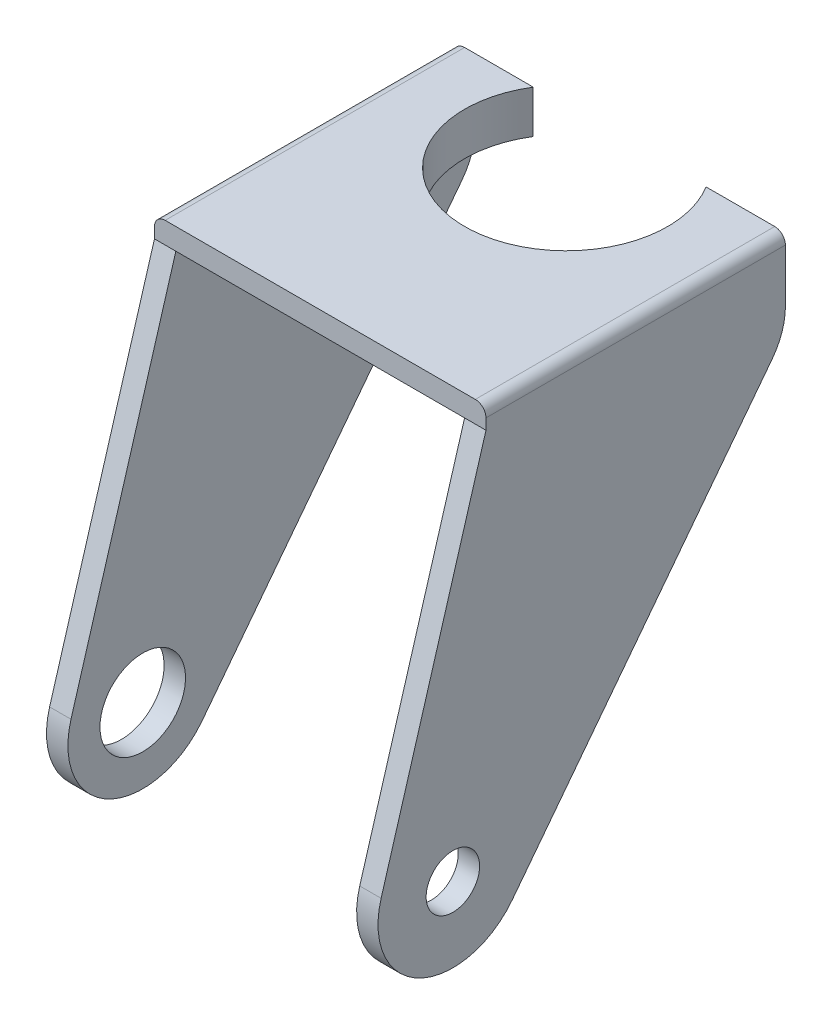
ISO-10303-21;
HEADER;
FILE_DESCRIPTION(('STEP AP214'),'2;1');
FILE_NAME('part.step','',(''),(''),'','','');
FILE_SCHEMA(('AUTOMOTIVE_DESIGN { 1 0 10303 214 1 1 1 1 }'));
ENDSEC;
DATA;
#1=APPLICATION_CONTEXT('core data for automotive mechanical design processes');
#2=APPLICATION_PROTOCOL_DEFINITION('international standard','automotive_design',2000,#1);
#3=PRODUCT_CONTEXT('',#1,'mechanical');
#4=PRODUCT('Part','Part','',(#3));
#5=PRODUCT_RELATED_PRODUCT_CATEGORY('part','',(#4));
#6=PRODUCT_DEFINITION_FORMATION('','',#4);
#7=PRODUCT_DEFINITION_CONTEXT('part definition',#1,'design');
#8=PRODUCT_DEFINITION('design','',#6,#7);
#9=PRODUCT_DEFINITION_SHAPE('','',#8);
#10=(LENGTH_UNIT() NAMED_UNIT(*) SI_UNIT(.MILLI.,.METRE.));
#11=(NAMED_UNIT(*) PLANE_ANGLE_UNIT() SI_UNIT($,.RADIAN.));
#12=(NAMED_UNIT(*) SI_UNIT($,.STERADIAN.) SOLID_ANGLE_UNIT());
#13=UNCERTAINTY_MEASURE_WITH_UNIT(LENGTH_MEASURE(1.E-05),#10,'distance_accuracy_value','');
#14=(GEOMETRIC_REPRESENTATION_CONTEXT(3) GLOBAL_UNCERTAINTY_ASSIGNED_CONTEXT((#13)) GLOBAL_UNIT_ASSIGNED_CONTEXT((#10,
#11,#12)) REPRESENTATION_CONTEXT('',''));
#15=CARTESIAN_POINT('',(0.,0.,0.));
#16=DIRECTION('',(0.,0.,1.));
#17=DIRECTION('',(1.,0.,0.));
#18=AXIS2_PLACEMENT_3D('',#15,#16,#17);
#19=CARTESIAN_POINT('',(-1.,18.4969997464512,-15.548289728614));
#20=DIRECTION('',(0.,0.,-1.));
#21=DIRECTION('',(0.,1.,0.));
#22=AXIS2_PLACEMENT_3D('',#19,#20,#21);
#23=PLANE('',#22);
#24=DIRECTION('',(0.,1.,0.));
#25=VECTOR('',#24,1.);
#26=CARTESIAN_POINT('',(-15.5,17.4969997464512,-15.548289728614));
#27=LINE('',#26,#25);
#28=CARTESIAN_POINT('',(-15.5,15.5161662727373,-15.548289728614));
#29=VERTEX_POINT('',#28);
#30=CARTESIAN_POINT('',(-15.5,17.9969997464512,-15.548289728614));
#31=VERTEX_POINT('',#30);
#32=EDGE_CURVE('E210',#29,#31,#27,.T.);
#33=ORIENTED_EDGE('',*,*,#32,.T.);
#34=CARTESIAN_POINT('',(-15.,17.9969997464512,-15.548289728614));
#35=DIRECTION('',(0.,0.,-1.));
#36=DIRECTION('',(0.,1.,0.));
#37=AXIS2_PLACEMENT_3D('',#34,#35,#36);
#38=CIRCLE('',#37,0.5);
#39=CARTESIAN_POINT('',(-15.,18.4969997464512,-15.548289728614));
#40=VERTEX_POINT('',#39);
#41=EDGE_CURVE('E281',#31,#40,#38,.T.);
#42=ORIENTED_EDGE('',*,*,#41,.T.);
#43=DIRECTION('',(1.,0.,0.));
#44=VECTOR('',#43,1.);
#45=CARTESIAN_POINT('',(-1.,18.4969997464512,-15.548289728614));
#46=LINE('',#45,#44);
#47=CARTESIAN_POINT('',(-12.9280787943023,18.4969997464512,-15.548289728614));
#48=VERTEX_POINT('',#47);
#49=EDGE_CURVE('E257',#40,#48,#46,.T.);
#50=ORIENTED_EDGE('',*,*,#49,.T.);
#51=DIRECTION('',(3.07167038101021E-13,1.,0.));
#52=VECTOR('',#51,1.);
#53=CARTESIAN_POINT('',(-12.9280787943023,18.4969997464549,-15.548289728614));
#54=LINE('',#53,#52);
#55=CARTESIAN_POINT('',(-12.9280787943023,17.4969997464512,-15.548289728614));
#56=VERTEX_POINT('',#55);
#57=EDGE_CURVE('E180',#56,#48,#54,.T.);
#58=ORIENTED_EDGE('',*,*,#57,.F.);
#59=DIRECTION('',(-1.,0.,0.));
#60=VECTOR('',#59,1.);
#61=CARTESIAN_POINT('',(-15.5,17.4969997464512,-15.548289728614));
#62=LINE('',#61,#60);
#63=CARTESIAN_POINT('',(-14.5,17.4969997464512,-15.548289728614));
#64=VERTEX_POINT('',#63);
#65=EDGE_CURVE('E201',#56,#64,#62,.T.);
#66=ORIENTED_EDGE('',*,*,#65,.T.);
#67=DIRECTION('',(0.,1.,0.));
#68=VECTOR('',#67,1.);
#69=CARTESIAN_POINT('',(-14.5,18.4969997464512,-15.548289728614));
#70=LINE('',#69,#68);
#71=CARTESIAN_POINT('',(-14.5,15.5161662727373,-15.548289728614));
#72=VERTEX_POINT('',#71);
#73=EDGE_CURVE('E327',#72,#64,#70,.T.);
#74=ORIENTED_EDGE('',*,*,#73,.F.);
#75=DIRECTION('',(-1.,0.,0.));
#76=VECTOR('',#75,1.);
#77=CARTESIAN_POINT('',(-14.5,15.5161662727373,-15.548289728614));
#78=LINE('',#77,#76);
#79=EDGE_CURVE('E346',#72,#29,#78,.T.);
#80=ORIENTED_EDGE('',*,*,#79,.T.);
#81=EDGE_LOOP('',(#33,#42,#50,#58,#66,#74,#80));
#82=FACE_BOUND('',#81,.T.);
#83=ADVANCED_FACE('F33',(#82),#23,.T.);
#84=CARTESIAN_POINT('',(0.,17.4969997464512,0.));
#85=DIRECTION('',(0.,1.,0.));
#86=DIRECTION('',(0.,0.,1.));
#87=AXIS2_PLACEMENT_3D('',#84,#85,#86);
#88=PLANE('',#87);
#89=ORIENTED_EDGE('',*,*,#65,.F.);
#90=CARTESIAN_POINT('',(-7.75,17.4969997464512,-13.048289728614));
#91=DIRECTION('',(0.,1.,0.));
#92=DIRECTION('',(0.,0.,1.));
#93=AXIS2_PLACEMENT_3D('',#90,#91,#92);
#94=CIRCLE('',#93,5.75);
#95=CARTESIAN_POINT('',(-2.57192120569801,17.4969997464512,-15.548289728614));
#96=VERTEX_POINT('',#95);
#97=EDGE_CURVE('E187',#56,#96,#94,.T.);
#98=ORIENTED_EDGE('',*,*,#97,.T.);
#99=CARTESIAN_POINT('',(-1.,17.4969997464512,-15.548289728614));
#100=VERTEX_POINT('',#99);
#101=EDGE_CURVE('E198',#100,#96,#62,.T.);
#102=ORIENTED_EDGE('',*,*,#101,.F.);
#103=DIRECTION('',(0.,0.,1.));
#104=VECTOR('',#103,1.);
#105=CARTESIAN_POINT('',(-1.,17.4969997464512,0.));
#106=LINE('',#105,#104);
#107=CARTESIAN_POINT('',(-1.,17.4969997464512,-1.54828972861397));
#108=VERTEX_POINT('',#107);
#109=EDGE_CURVE('E216',#100,#108,#106,.T.);
#110=ORIENTED_EDGE('',*,*,#109,.T.);
#111=DIRECTION('',(1.,0.,0.));
#112=VECTOR('',#111,1.);
#113=CARTESIAN_POINT('',(-15.5,17.4969997464512,-1.54828972861397));
#114=LINE('',#113,#112);
#115=CARTESIAN_POINT('',(-14.5,17.4969997464512,-1.54828972861397));
#116=VERTEX_POINT('',#115);
#117=EDGE_CURVE('E295',#116,#108,#114,.T.);
#118=ORIENTED_EDGE('',*,*,#117,.F.);
#119=DIRECTION('',(0.,0.,1.));
#120=VECTOR('',#119,1.);
#121=CARTESIAN_POINT('',(-14.5,17.4969997464512,0.));
#122=LINE('',#121,#120);
#123=EDGE_CURVE('E181',#64,#116,#122,.T.);
#124=ORIENTED_EDGE('',*,*,#123,.F.);
#125=EDGE_LOOP('',(#89,#98,#102,#110,#118,#124));
#126=FACE_BOUND('',#125,.T.);
#127=ADVANCED_FACE('F196',(#126),#88,.F.);
#128=CARTESIAN_POINT('',(-1.,0.,0.));
#129=DIRECTION('',(1.,0.,0.));
#130=DIRECTION('',(0.,0.,-1.));
#131=AXIS2_PLACEMENT_3D('',#128,#129,#130);
#132=PLANE('',#131);
#133=CARTESIAN_POINT('',(-1.,0.,0.));
#134=DIRECTION('',(1.,0.,0.));
#135=DIRECTION('',(0.,0.,-1.));
#136=AXIS2_PLACEMENT_3D('',#133,#134,#135);
#137=CIRCLE('',#136,1.25);
#138=CARTESIAN_POINT('',(-1.,0.,-1.25));
#139=VERTEX_POINT('',#138);
#140=EDGE_CURVE('E405',#139,#139,#137,.T.);
#141=ORIENTED_EDGE('',*,*,#140,.T.);
#142=EDGE_LOOP('',(#141));
#143=FACE_BOUND('',#142,.T.);
#144=ORIENTED_EDGE('',*,*,#109,.F.);
#145=DIRECTION('',(0.,1.,0.));
#146=VECTOR('',#145,1.);
#147=CARTESIAN_POINT('',(-1.,18.4969997464512,-15.548289728614));
#148=LINE('',#147,#146);
#149=CARTESIAN_POINT('',(-1.,15.5161662727373,-15.548289728614));
#150=VERTEX_POINT('',#149);
#151=EDGE_CURVE('E207',#150,#100,#148,.T.);
#152=ORIENTED_EDGE('',*,*,#151,.F.);
#153=CARTESIAN_POINT('',(-1.,15.5161662727373,-12.548289728614));
#154=DIRECTION('',(1.,0.,0.));
#155=DIRECTION('',(0.,0.,1.));
#156=AXIS2_PLACEMENT_3D('',#153,#154,#155);
#157=CIRCLE('',#156,3.);
#158=CARTESIAN_POINT('',(-1.,13.6887387445706,-14.9274720733069));
#159=VERTEX_POINT('',#158);
#160=EDGE_CURVE('E227',#159,#150,#157,.T.);
#161=ORIENTED_EDGE('',*,*,#160,.F.);
#162=DIRECTION('',(0.,0.793060781564328,-0.609142509388876));
#163=VECTOR('',#162,1.);
#164=CARTESIAN_POINT('',(-1.,13.6887387445706,-14.9274720733069));
#165=LINE('',#164,#163);
#166=CARTESIAN_POINT('',(-1.,-2.13199878286107,-2.77571273547515));
#167=VERTEX_POINT('',#166);
#168=EDGE_CURVE('E223',#167,#159,#165,.T.);
#169=ORIENTED_EDGE('',*,*,#168,.F.);
#170=CARTESIAN_POINT('',(-1.,0.,0.));
#171=DIRECTION('',(1.,0.,0.));
#172=DIRECTION('',(0.,0.,-1.));
#173=AXIS2_PLACEMENT_3D('',#170,#171,#172);
#174=CIRCLE('',#173,3.5);
#175=CARTESIAN_POINT('',(-1.,0.996999746451241,3.35499500827887));
#176=VERTEX_POINT('',#175);
#177=EDGE_CURVE('E220',#176,#167,#174,.T.);
#178=ORIENTED_EDGE('',*,*,#177,.F.);
#179=DIRECTION('',(0.,-0.958570002365392,0.28485707041464));
#180=VECTOR('',#179,1.);
#181=CARTESIAN_POINT('',(-1.,0.996999746451241,3.35499500827887));
#182=LINE('',#181,#180);
#183=EDGE_CURVE('E231',#108,#176,#182,.T.);
#184=ORIENTED_EDGE('',*,*,#183,.F.);
#185=EDGE_LOOP('',(#144,#152,#161,#169,#178,#184));
#186=FACE_BOUND('',#185,.T.);
#187=ADVANCED_FACE('F312',(#143,#186),#132,.F.);
#188=CARTESIAN_POINT('',(-1.,0.,0.));
#189=DIRECTION('',(1.,0.,0.));
#190=DIRECTION('',(0.,0.,-1.));
#191=AXIS2_PLACEMENT_3D('',#188,#189,#190);
#192=CYLINDRICAL_SURFACE('',#191,3.5);
#193=CARTESIAN_POINT('',(0.,0.,0.));
#194=DIRECTION('',(1.,0.,0.));
#195=DIRECTION('',(0.,0.,-1.));
#196=AXIS2_PLACEMENT_3D('',#193,#194,#195);
#197=CIRCLE('',#196,3.5);
#198=CARTESIAN_POINT('',(0.,0.996999746451241,3.35499500827887));
#199=VERTEX_POINT('',#198);
#200=CARTESIAN_POINT('',(0.,-2.13199878286107,-2.77571273547515));
#201=VERTEX_POINT('',#200);
#202=EDGE_CURVE('E219',#199,#201,#197,.T.);
#203=ORIENTED_EDGE('',*,*,#202,.F.);
#204=DIRECTION('',(1.,0.,0.));
#205=VECTOR('',#204,1.);
#206=CARTESIAN_POINT('',(-1.,0.996999746451241,3.35499500827887));
#207=LINE('',#206,#205);
#208=EDGE_CURVE('E249',#176,#199,#207,.T.);
#209=ORIENTED_EDGE('',*,*,#208,.F.);
#210=ORIENTED_EDGE('',*,*,#177,.T.);
#211=DIRECTION('',(1.,0.,0.));
#212=VECTOR('',#211,1.);
#213=CARTESIAN_POINT('',(-1.,-2.13199878286107,-2.77571273547515));
#214=LINE('',#213,#212);
#215=EDGE_CURVE('E234',#167,#201,#214,.T.);
#216=ORIENTED_EDGE('',*,*,#215,.T.);
#217=EDGE_LOOP('',(#203,#209,#210,#216));
#218=FACE_BOUND('',#217,.T.);
#219=ADVANCED_FACE('F302',(#218),#192,.T.);
#220=CARTESIAN_POINT('',(-1.,0.996999746451241,3.35499500827887));
#221=DIRECTION('',(0.,0.28485707041464,0.958570002365393));
#222=DIRECTION('',(0.,-0.958570002365393,0.28485707041464));
#223=AXIS2_PLACEMENT_3D('',#220,#221,#222);
#224=PLANE('',#223);
#225=DIRECTION('',(0.,-0.958570002365392,0.28485707041464));
#226=VECTOR('',#225,1.);
#227=CARTESIAN_POINT('',(0.,0.996999746451241,3.35499500827887));
#228=LINE('',#227,#226);
#229=CARTESIAN_POINT('',(0.,17.4969997464512,-1.54828972861397));
#230=VERTEX_POINT('',#229);
#231=EDGE_CURVE('E224',#230,#199,#228,.T.);
#232=ORIENTED_EDGE('',*,*,#231,.F.);
#233=DIRECTION('',(1.,0.,0.));
#234=VECTOR('',#233,1.);
#235=CARTESIAN_POINT('',(-1.,17.4969997464512,-1.54828972861397));
#236=LINE('',#235,#234);
#237=EDGE_CURVE('E251',#108,#230,#236,.T.);
#238=ORIENTED_EDGE('',*,*,#237,.F.);
#239=ORIENTED_EDGE('',*,*,#183,.T.);
#240=ORIENTED_EDGE('',*,*,#208,.T.);
#241=EDGE_LOOP('',(#232,#238,#239,#240));
#242=FACE_BOUND('',#241,.T.);
#243=ADVANCED_FACE('F298',(#242),#224,.T.);
#244=CARTESIAN_POINT('',(-1.,17.4969997464512,-1.54828972861397));
#245=DIRECTION('',(0.,0.,1.));
#246=DIRECTION('',(1.,0.,0.));
#247=AXIS2_PLACEMENT_3D('',#244,#245,#246);
#248=PLANE('',#247);
#249=DIRECTION('',(1.,0.,0.));
#250=VECTOR('',#249,1.);
#251=CARTESIAN_POINT('',(-1.,18.4969997464512,-1.54828972861397));
#252=LINE('',#251,#250);
#253=CARTESIAN_POINT('',(-15.,18.4969997464512,-1.54828972861397));
#254=VERTEX_POINT('',#253);
#255=CARTESIAN_POINT('',(-0.5,18.4969997464512,-1.54828972861397));
#256=VERTEX_POINT('',#255);
#257=EDGE_CURVE('E254',#254,#256,#252,.T.);
#258=ORIENTED_EDGE('',*,*,#257,.F.);
#259=CARTESIAN_POINT('',(-15.,17.9969997464512,-1.54828972861397));
#260=DIRECTION('',(0.,0.,1.));
#261=DIRECTION('',(1.,0.,0.));
#262=AXIS2_PLACEMENT_3D('',#259,#260,#261);
#263=CIRCLE('',#262,0.5);
#264=CARTESIAN_POINT('',(-15.5,17.9969997464512,-1.54828972861397));
#265=VERTEX_POINT('',#264);
#266=EDGE_CURVE('E278',#254,#265,#263,.T.);
#267=ORIENTED_EDGE('',*,*,#266,.T.);
#268=DIRECTION('',(0.,1.,0.));
#269=VECTOR('',#268,1.);
#270=CARTESIAN_POINT('',(-15.5,17.4969997464512,-1.54828972861397));
#271=LINE('',#270,#269);
#272=CARTESIAN_POINT('',(-15.5,17.4969997464512,-1.54828972861397));
#273=VERTEX_POINT('',#272);
#274=EDGE_CURVE('E208',#273,#265,#271,.T.);
#275=ORIENTED_EDGE('',*,*,#274,.F.);
#276=EDGE_CURVE('E212',#273,#116,#114,.T.);
#277=ORIENTED_EDGE('',*,*,#276,.T.);
#278=ORIENTED_EDGE('',*,*,#117,.T.);
#279=ORIENTED_EDGE('',*,*,#237,.T.);
#280=DIRECTION('',(0.,-1.,0.));
#281=VECTOR('',#280,1.);
#282=CARTESIAN_POINT('',(0.,17.4969997464512,-1.54828972861397));
#283=LINE('',#282,#281);
#284=CARTESIAN_POINT('',(0.,17.9969997464512,-1.54828972861397));
#285=VERTEX_POINT('',#284);
#286=EDGE_CURVE('E245',#285,#230,#283,.T.);
#287=ORIENTED_EDGE('',*,*,#286,.F.);
#288=CARTESIAN_POINT('',(-0.5,17.9969997464512,-1.54828972861397));
#289=DIRECTION('',(0.,0.,1.));
#290=DIRECTION('',(1.,0.,0.));
#291=AXIS2_PLACEMENT_3D('',#288,#289,#290);
#292=CIRCLE('',#291,0.5);
#293=EDGE_CURVE('E276',#285,#256,#292,.T.);
#294=ORIENTED_EDGE('',*,*,#293,.T.);
#295=EDGE_LOOP('',(#258,#267,#275,#277,#278,#279,#287,#294));
#296=FACE_BOUND('',#295,.T.);
#297=ADVANCED_FACE('F290',(#296),#248,.T.);
#298=CARTESIAN_POINT('',(-1.,18.4969997464512,-1.54828972861397));
#299=DIRECTION('',(0.,1.,0.));
#300=DIRECTION('',(0.,0.,1.));
#301=AXIS2_PLACEMENT_3D('',#298,#299,#300);
#302=PLANE('',#301);
#303=ORIENTED_EDGE('',*,*,#49,.F.);
#304=DIRECTION('',(0.,0.,1.));
#305=VECTOR('',#304,1.);
#306=CARTESIAN_POINT('',(-15.,18.4969997464512,-1.54828972861397));
#307=LINE('',#306,#305);
#308=EDGE_CURVE('E273',#40,#254,#307,.T.);
#309=ORIENTED_EDGE('',*,*,#308,.T.);
#310=ORIENTED_EDGE('',*,*,#257,.T.);
#311=DIRECTION('',(0.,0.,1.));
#312=VECTOR('',#311,1.);
#313=CARTESIAN_POINT('',(-0.5,18.4969997464512,-1.54828972861397));
#314=LINE('',#313,#312);
#315=CARTESIAN_POINT('',(-0.5,18.4969997464512,-15.548289728614));
#316=VERTEX_POINT('',#315);
#317=EDGE_CURVE('E271',#256,#316,#314,.F.);
#318=ORIENTED_EDGE('',*,*,#317,.T.);
#319=CARTESIAN_POINT('',(-2.57192120569801,18.4969997464512,-15.548289728614));
#320=VERTEX_POINT('',#319);
#321=EDGE_CURVE('E259',#320,#316,#46,.T.);
#322=ORIENTED_EDGE('',*,*,#321,.F.);
#323=DIRECTION('',(0.99999820524696,0.,-0.00189459833726096));
#324=VECTOR('',#323,1.);
#325=CARTESIAN_POINT('',(-1.02652997153261,18.4969997464512,-15.5512176295315));
#326=LINE('',#325,#324);
#327=CARTESIAN_POINT('',(-3.70979277514982,18.4969997464512,-15.5461339151613));
#328=VERTEX_POINT('',#327);
#329=EDGE_CURVE('E177',#328,#320,#326,.T.);
#330=ORIENTED_EDGE('',*,*,#329,.F.);
#331=CARTESIAN_POINT('',(-7.75,18.4969997464512,-13.048289728614));
#332=DIRECTION('',(0.,1.,0.));
#333=DIRECTION('',(0.,0.,1.));
#334=AXIS2_PLACEMENT_3D('',#331,#332,#333);
#335=CIRCLE('',#334,4.75);
#336=CARTESIAN_POINT('',(-11.7902072248502,18.4969997464512,-15.5461339151613));
#337=VERTEX_POINT('',#336);
#338=EDGE_CURVE('E268',#337,#328,#335,.T.);
#339=ORIENTED_EDGE('',*,*,#338,.F.);
#340=DIRECTION('',(0.99999820524696,0.,0.00189459833725892));
#341=VECTOR('',#340,1.);
#342=CARTESIAN_POINT('',(-0.973518486756022,18.4969997464512,-15.525640597883));
#343=LINE('',#342,#341);
#344=EDGE_CURVE('E396',#48,#337,#343,.T.);
#345=ORIENTED_EDGE('',*,*,#344,.F.);
#346=EDGE_LOOP('',(#303,#309,#310,#318,#322,#330,#339,#345));
#347=FACE_BOUND('',#346,.T.);
#348=ADVANCED_FACE('F367',(#347),#302,.T.);
#349=ORIENTED_EDGE('',*,*,#321,.T.);
#350=CARTESIAN_POINT('',(-0.5,17.9969997464512,-15.548289728614));
#351=DIRECTION('',(0.,0.,-1.));
#352=DIRECTION('',(0.,1.,0.));
#353=AXIS2_PLACEMENT_3D('',#350,#351,#352);
#354=CIRCLE('',#353,0.5);
#355=CARTESIAN_POINT('',(0.,17.9969997464512,-15.548289728614));
#356=VERTEX_POINT('',#355);
#357=EDGE_CURVE('E11',#316,#356,#354,.T.);
#358=ORIENTED_EDGE('',*,*,#357,.T.);
#359=DIRECTION('',(0.,1.,0.));
#360=VECTOR('',#359,1.);
#361=CARTESIAN_POINT('',(0.,18.4969997464512,-15.548289728614));
#362=LINE('',#361,#360);
#363=CARTESIAN_POINT('',(0.,15.5161662727373,-15.548289728614));
#364=VERTEX_POINT('',#363);
#365=EDGE_CURVE('E243',#364,#356,#362,.T.);
#366=ORIENTED_EDGE('',*,*,#365,.F.);
#367=DIRECTION('',(1.,0.,0.));
#368=VECTOR('',#367,1.);
#369=CARTESIAN_POINT('',(-1.,15.5161662727373,-15.548289728614));
#370=LINE('',#369,#368);
#371=EDGE_CURVE('E260',#150,#364,#370,.T.);
#372=ORIENTED_EDGE('',*,*,#371,.F.);
#373=ORIENTED_EDGE('',*,*,#151,.T.);
#374=ORIENTED_EDGE('',*,*,#101,.T.);
#375=DIRECTION('',(3.0716703810069E-13,-1.,0.));
#376=VECTOR('',#375,1.);
#377=CARTESIAN_POINT('',(-2.57192120569801,18.4969997464508,-15.548289728614));
#378=LINE('',#377,#376);
#379=EDGE_CURVE('E170',#320,#96,#378,.T.);
#380=ORIENTED_EDGE('',*,*,#379,.F.);
#381=EDGE_LOOP('',(#349,#358,#366,#372,#373,#374,#380));
#382=FACE_BOUND('',#381,.T.);
#383=ADVANCED_FACE('F205',(#382),#23,.T.);
#384=CARTESIAN_POINT('',(-1.,15.5161662727373,-12.548289728614));
#385=DIRECTION('',(1.,0.,0.));
#386=DIRECTION('',(0.,0.,-1.));
#387=AXIS2_PLACEMENT_3D('',#384,#385,#386);
#388=CYLINDRICAL_SURFACE('',#387,3.);
#389=CARTESIAN_POINT('',(0.,15.5161662727373,-12.548289728614));
#390=DIRECTION('',(1.,0.,0.));
#391=DIRECTION('',(0.,0.,1.));
#392=AXIS2_PLACEMENT_3D('',#389,#390,#391);
#393=CIRCLE('',#392,3.);
#394=CARTESIAN_POINT('',(0.,13.6887387445706,-14.9274720733069));
#395=VERTEX_POINT('',#394);
#396=EDGE_CURVE('E240',#395,#364,#393,.T.);
#397=ORIENTED_EDGE('',*,*,#396,.F.);
#398=DIRECTION('',(1.,0.,0.));
#399=VECTOR('',#398,1.);
#400=CARTESIAN_POINT('',(-1.,13.6887387445706,-14.9274720733069));
#401=LINE('',#400,#399);
#402=EDGE_CURVE('E262',#159,#395,#401,.T.);
#403=ORIENTED_EDGE('',*,*,#402,.F.);
#404=ORIENTED_EDGE('',*,*,#160,.T.);
#405=ORIENTED_EDGE('',*,*,#371,.T.);
#406=EDGE_LOOP('',(#397,#403,#404,#405));
#407=FACE_BOUND('',#406,.T.);
#408=ADVANCED_FACE('F310',(#407),#388,.T.);
#409=CARTESIAN_POINT('',(-1.,13.6887387445706,-14.9274720733069));
#410=DIRECTION('',(0.,-0.609142509388876,-0.793060781564328));
#411=DIRECTION('',(0.,0.793060781564328,-0.609142509388876));
#412=AXIS2_PLACEMENT_3D('',#409,#410,#411);
#413=PLANE('',#412);
#414=DIRECTION('',(0.,0.793060781564328,-0.609142509388876));
#415=VECTOR('',#414,1.);
#416=CARTESIAN_POINT('',(0.,13.6887387445706,-14.9274720733069));
#417=LINE('',#416,#415);
#418=EDGE_CURVE('E237',#201,#395,#417,.T.);
#419=ORIENTED_EDGE('',*,*,#418,.F.);
#420=ORIENTED_EDGE('',*,*,#215,.F.);
#421=ORIENTED_EDGE('',*,*,#168,.T.);
#422=ORIENTED_EDGE('',*,*,#402,.T.);
#423=EDGE_LOOP('',(#419,#420,#421,#422));
#424=FACE_BOUND('',#423,.T.);
#425=ADVANCED_FACE('F306',(#424),#413,.T.);
#426=CARTESIAN_POINT('',(0.,0.,0.));
#427=DIRECTION('',(1.,0.,0.));
#428=DIRECTION('',(0.,0.,-1.));
#429=AXIS2_PLACEMENT_3D('',#426,#427,#428);
#430=PLANE('',#429);
#431=CARTESIAN_POINT('',(0.,0.,0.));
#432=DIRECTION('',(1.,0.,0.));
#433=DIRECTION('',(0.,0.,-1.));
#434=AXIS2_PLACEMENT_3D('',#431,#432,#433);
#435=CIRCLE('',#434,1.25);
#436=CARTESIAN_POINT('',(0.,0.,-1.25));
#437=VERTEX_POINT('',#436);
#438=EDGE_CURVE('E408',#437,#437,#435,.T.);
#439=ORIENTED_EDGE('',*,*,#438,.F.);
#440=EDGE_LOOP('',(#439));
#441=FACE_BOUND('',#440,.T.);
#442=ORIENTED_EDGE('',*,*,#365,.T.);
#443=DIRECTION('',(0.,0.,1.));
#444=VECTOR('',#443,1.);
#445=CARTESIAN_POINT('',(0.,17.9969997464512,0.));
#446=LINE('',#445,#444);
#447=EDGE_CURVE('E41',#356,#285,#446,.T.);
#448=ORIENTED_EDGE('',*,*,#447,.T.);
#449=ORIENTED_EDGE('',*,*,#286,.T.);
#450=ORIENTED_EDGE('',*,*,#231,.T.);
#451=ORIENTED_EDGE('',*,*,#202,.T.);
#452=ORIENTED_EDGE('',*,*,#418,.T.);
#453=ORIENTED_EDGE('',*,*,#396,.T.);
#454=EDGE_LOOP('',(#442,#448,#449,#450,#451,#452,#453));
#455=FACE_BOUND('',#454,.T.);
#456=ADVANCED_FACE('F286',(#441,#455),#430,.T.);
#457=CARTESIAN_POINT('',(-15.5,17.4969997464512,-15.548289728614));
#458=DIRECTION('',(-1.,0.,0.));
#459=DIRECTION('',(0.,0.,1.));
#460=AXIS2_PLACEMENT_3D('',#457,#458,#459);
#461=PLANE('',#460);
#462=CARTESIAN_POINT('',(-15.5,0.,0.));
#463=DIRECTION('',(-1.,0.,0.));
#464=DIRECTION('',(0.,0.,1.));
#465=AXIS2_PLACEMENT_3D('',#462,#463,#464);
#466=CIRCLE('',#465,2.);
#467=CARTESIAN_POINT('',(-15.5,0.,2.));
#468=VERTEX_POINT('',#467);
#469=EDGE_CURVE('E399',#468,#468,#466,.F.);
#470=ORIENTED_EDGE('',*,*,#469,.T.);
#471=EDGE_LOOP('',(#470));
#472=FACE_BOUND('',#471,.T.);
#473=ORIENTED_EDGE('',*,*,#274,.T.);
#474=DIRECTION('',(0.,0.,1.));
#475=VECTOR('',#474,1.);
#476=CARTESIAN_POINT('',(-15.5,17.9969997464512,-15.548289728614));
#477=LINE('',#476,#475);
#478=EDGE_CURVE('E54',#265,#31,#477,.F.);
#479=ORIENTED_EDGE('',*,*,#478,.T.);
#480=ORIENTED_EDGE('',*,*,#32,.F.);
#481=CARTESIAN_POINT('',(-15.5,15.5161662727373,-12.548289728614));
#482=DIRECTION('',(1.,0.,0.));
#483=DIRECTION('',(0.,0.,1.));
#484=AXIS2_PLACEMENT_3D('',#481,#482,#483);
#485=CIRCLE('',#484,3.);
#486=CARTESIAN_POINT('',(-15.5,13.6887387445706,-14.9274720733069));
#487=VERTEX_POINT('',#486);
#488=EDGE_CURVE('E340',#487,#29,#485,.T.);
#489=ORIENTED_EDGE('',*,*,#488,.F.);
#490=DIRECTION('',(0.,0.793060781564328,-0.609142509388876));
#491=VECTOR('',#490,1.);
#492=CARTESIAN_POINT('',(-15.5,13.6887387445706,-14.9274720733069));
#493=LINE('',#492,#491);
#494=CARTESIAN_POINT('',(-15.5,-2.13199878286107,-2.77571273547515));
#495=VERTEX_POINT('',#494);
#496=EDGE_CURVE('E338',#495,#487,#493,.T.);
#497=ORIENTED_EDGE('',*,*,#496,.F.);
#498=CARTESIAN_POINT('',(-15.5,0.,0.));
#499=DIRECTION('',(1.,0.,0.));
#500=DIRECTION('',(0.,0.,-1.));
#501=AXIS2_PLACEMENT_3D('',#498,#499,#500);
#502=CIRCLE('',#501,3.5);
#503=CARTESIAN_POINT('',(-15.5,0.996999746451241,3.35499500827887));
#504=VERTEX_POINT('',#503);
#505=EDGE_CURVE('E202',#504,#495,#502,.T.);
#506=ORIENTED_EDGE('',*,*,#505,.F.);
#507=DIRECTION('',(0.,-0.958570002365392,0.28485707041464));
#508=VECTOR('',#507,1.);
#509=CARTESIAN_POINT('',(-15.5,0.996999746451241,3.35499500827887));
#510=LINE('',#509,#508);
#511=EDGE_CURVE('E320',#273,#504,#510,.T.);
#512=ORIENTED_EDGE('',*,*,#511,.F.);
#513=EDGE_LOOP('',(#473,#479,#480,#489,#497,#506,#512));
#514=FACE_BOUND('',#513,.T.);
#515=ADVANCED_FACE('F357',(#472,#514),#461,.T.);
#516=CARTESIAN_POINT('',(-14.5,0.,0.));
#517=DIRECTION('',(-1.,0.,0.));
#518=DIRECTION('',(0.,0.,-1.));
#519=AXIS2_PLACEMENT_3D('',#516,#517,#518);
#520=PLANE('',#519);
#521=CARTESIAN_POINT('',(-14.5,0.,0.));
#522=DIRECTION('',(-1.,0.,0.));
#523=DIRECTION('',(0.,0.,1.));
#524=AXIS2_PLACEMENT_3D('',#521,#522,#523);
#525=CIRCLE('',#524,2.);
#526=CARTESIAN_POINT('',(-14.5,0.,2.));
#527=VERTEX_POINT('',#526);
#528=EDGE_CURVE('E402',#527,#527,#525,.T.);
#529=ORIENTED_EDGE('',*,*,#528,.T.);
#530=EDGE_LOOP('',(#529));
#531=FACE_BOUND('',#530,.T.);
#532=ORIENTED_EDGE('',*,*,#73,.T.);
#533=ORIENTED_EDGE('',*,*,#123,.T.);
#534=DIRECTION('',(0.,-0.958570002365392,0.28485707041464));
#535=VECTOR('',#534,1.);
#536=CARTESIAN_POINT('',(-14.5,0.996999746451241,3.35499500827887));
#537=LINE('',#536,#535);
#538=CARTESIAN_POINT('',(-14.5,0.996999746451241,3.35499500827887));
#539=VERTEX_POINT('',#538);
#540=EDGE_CURVE('E322',#116,#539,#537,.T.);
#541=ORIENTED_EDGE('',*,*,#540,.T.);
#542=CARTESIAN_POINT('',(-14.5,0.,0.));
#543=DIRECTION('',(1.,0.,0.));
#544=DIRECTION('',(0.,0.,-1.));
#545=AXIS2_PLACEMENT_3D('',#542,#543,#544);
#546=CIRCLE('',#545,3.5);
#547=CARTESIAN_POINT('',(-14.5,-2.13199878286107,-2.77571273547515));
#548=VERTEX_POINT('',#547);
#549=EDGE_CURVE('E344',#539,#548,#546,.T.);
#550=ORIENTED_EDGE('',*,*,#549,.T.);
#551=DIRECTION('',(0.,0.793060781564328,-0.609142509388876));
#552=VECTOR('',#551,1.);
#553=CARTESIAN_POINT('',(-14.5,13.6887387445706,-14.9274720733069));
#554=LINE('',#553,#552);
#555=CARTESIAN_POINT('',(-14.5,13.6887387445706,-14.9274720733069));
#556=VERTEX_POINT('',#555);
#557=EDGE_CURVE('E373',#548,#556,#554,.T.);
#558=ORIENTED_EDGE('',*,*,#557,.T.);
#559=CARTESIAN_POINT('',(-14.5,15.5161662727373,-12.548289728614));
#560=DIRECTION('',(1.,0.,0.));
#561=DIRECTION('',(0.,0.,1.));
#562=AXIS2_PLACEMENT_3D('',#559,#560,#561);
#563=CIRCLE('',#562,3.);
#564=EDGE_CURVE('E332',#556,#72,#563,.T.);
#565=ORIENTED_EDGE('',*,*,#564,.T.);
#566=EDGE_LOOP('',(#532,#533,#541,#550,#558,#565));
#567=FACE_BOUND('',#566,.T.);
#568=ADVANCED_FACE('F377',(#531,#567),#520,.F.);
#569=CARTESIAN_POINT('',(-14.5,0.,0.));
#570=DIRECTION('',(-1.,0.,0.));
#571=DIRECTION('',(0.,0.,-1.));
#572=AXIS2_PLACEMENT_3D('',#569,#570,#571);
#573=CYLINDRICAL_SURFACE('',#572,3.5);
#574=ORIENTED_EDGE('',*,*,#505,.T.);
#575=DIRECTION('',(-1.,0.,0.));
#576=VECTOR('',#575,1.);
#577=CARTESIAN_POINT('',(-14.5,-2.13199878286107,-2.77571273547515));
#578=LINE('',#577,#576);
#579=EDGE_CURVE('E326',#548,#495,#578,.T.);
#580=ORIENTED_EDGE('',*,*,#579,.F.);
#581=ORIENTED_EDGE('',*,*,#549,.F.);
#582=DIRECTION('',(-1.,0.,0.));
#583=VECTOR('',#582,1.);
#584=CARTESIAN_POINT('',(-14.5,0.996999746451241,3.35499500827887));
#585=LINE('',#584,#583);
#586=EDGE_CURVE('E313',#539,#504,#585,.T.);
#587=ORIENTED_EDGE('',*,*,#586,.T.);
#588=EDGE_LOOP('',(#574,#580,#581,#587));
#589=FACE_BOUND('',#588,.T.);
#590=ADVANCED_FACE('F372',(#589),#573,.T.);
#591=CARTESIAN_POINT('',(-14.5,0.996999746451241,3.35499500827887));
#592=DIRECTION('',(0.,0.28485707041464,0.958570002365393));
#593=DIRECTION('',(0.,-0.958570002365393,0.28485707041464));
#594=AXIS2_PLACEMENT_3D('',#591,#592,#593);
#595=PLANE('',#594);
#596=ORIENTED_EDGE('',*,*,#511,.T.);
#597=ORIENTED_EDGE('',*,*,#586,.F.);
#598=ORIENTED_EDGE('',*,*,#540,.F.);
#599=ORIENTED_EDGE('',*,*,#276,.F.);
#600=EDGE_LOOP('',(#596,#597,#598,#599));
#601=FACE_BOUND('',#600,.T.);
#602=ADVANCED_FACE('F318',(#601),#595,.T.);
#603=CARTESIAN_POINT('',(-14.5,15.5161662727373,-12.548289728614));
#604=DIRECTION('',(-1.,0.,0.));
#605=DIRECTION('',(0.,0.,-1.));
#606=AXIS2_PLACEMENT_3D('',#603,#604,#605);
#607=CYLINDRICAL_SURFACE('',#606,3.);
#608=ORIENTED_EDGE('',*,*,#488,.T.);
#609=ORIENTED_EDGE('',*,*,#79,.F.);
#610=ORIENTED_EDGE('',*,*,#564,.F.);
#611=DIRECTION('',(-1.,0.,0.));
#612=VECTOR('',#611,1.);
#613=CARTESIAN_POINT('',(-14.5,13.6887387445706,-14.9274720733069));
#614=LINE('',#613,#612);
#615=EDGE_CURVE('E330',#556,#487,#614,.T.);
#616=ORIENTED_EDGE('',*,*,#615,.T.);
#617=EDGE_LOOP('',(#608,#609,#610,#616));
#618=FACE_BOUND('',#617,.T.);
#619=ADVANCED_FACE('F354',(#618),#607,.T.);
#620=CARTESIAN_POINT('',(-14.5,13.6887387445706,-14.9274720733069));
#621=DIRECTION('',(0.,-0.609142509388876,-0.793060781564328));
#622=DIRECTION('',(0.,0.793060781564328,-0.609142509388876));
#623=AXIS2_PLACEMENT_3D('',#620,#621,#622);
#624=PLANE('',#623);
#625=ORIENTED_EDGE('',*,*,#496,.T.);
#626=ORIENTED_EDGE('',*,*,#615,.F.);
#627=ORIENTED_EDGE('',*,*,#557,.F.);
#628=ORIENTED_EDGE('',*,*,#579,.T.);
#629=EDGE_LOOP('',(#625,#626,#627,#628));
#630=FACE_BOUND('',#629,.T.);
#631=ADVANCED_FACE('F476',(#630),#624,.T.);
#632=CARTESIAN_POINT('',(-7.75,16.4969997464512,-13.048289728614));
#633=DIRECTION('',(0.,1.,0.));
#634=DIRECTION('',(0.,0.,1.));
#635=AXIS2_PLACEMENT_3D('',#632,#633,#634);
#636=CYLINDRICAL_SURFACE('',#635,4.75);
#637=DIRECTION('',(0.,1.,0.));
#638=VECTOR('',#637,1.);
#639=CARTESIAN_POINT('',(-11.7902072248502,16.4969997464512,-15.5461339151613));
#640=LINE('',#639,#638);
#641=CARTESIAN_POINT('',(-11.7902072248502,16.4969997464512,-15.5461339151613));
#642=VERTEX_POINT('',#641);
#643=EDGE_CURVE('E385',#642,#337,#640,.T.);
#644=ORIENTED_EDGE('',*,*,#643,.T.);
#645=ORIENTED_EDGE('',*,*,#338,.T.);
#646=DIRECTION('',(0.,1.,0.));
#647=VECTOR('',#646,1.);
#648=CARTESIAN_POINT('',(-3.70979277514982,16.4969997464512,-15.5461339151613));
#649=LINE('',#648,#647);
#650=CARTESIAN_POINT('',(-3.70979277514982,16.4969997464512,-15.5461339151613));
#651=VERTEX_POINT('',#650);
#652=EDGE_CURVE('E192',#651,#328,#649,.T.);
#653=ORIENTED_EDGE('',*,*,#652,.F.);
#654=CARTESIAN_POINT('',(-7.75,16.4969997464512,-13.048289728614));
#655=DIRECTION('',(0.,-1.,0.));
#656=DIRECTION('',(0.,0.,1.));
#657=AXIS2_PLACEMENT_3D('',#654,#655,#656);
#658=CIRCLE('',#657,4.75);
#659=EDGE_CURVE('E393',#651,#642,#658,.T.);
#660=ORIENTED_EDGE('',*,*,#659,.T.);
#661=EDGE_LOOP('',(#644,#645,#653,#660));
#662=FACE_BOUND('',#661,.T.);
#663=ADVANCED_FACE('F471',(#662),#636,.F.);
#664=CARTESIAN_POINT('',(-3.70979277514982,16.4969997464512,-15.5461339151613));
#665=DIRECTION('',(-0.00189459833726096,0.,-0.99999820524696));
#666=DIRECTION('',(-0.99999820524696,0.,0.00189459833726096));
#667=AXIS2_PLACEMENT_3D('',#664,#665,#666);
#668=PLANE('',#667);
#669=ORIENTED_EDGE('',*,*,#652,.T.);
#670=ORIENTED_EDGE('',*,*,#329,.T.);
#671=ORIENTED_EDGE('',*,*,#379,.T.);
#672=DIRECTION('',(0.,1.,0.));
#673=VECTOR('',#672,1.);
#674=CARTESIAN_POINT('',(-2.57192120569801,16.4969997464512,-15.548289728614));
#675=LINE('',#674,#673);
#676=CARTESIAN_POINT('',(-2.57192120569801,16.4969997464512,-15.548289728614));
#677=VERTEX_POINT('',#676);
#678=EDGE_CURVE('E174',#677,#96,#675,.T.);
#679=ORIENTED_EDGE('',*,*,#678,.F.);
#680=DIRECTION('',(-0.99999820524696,0.,0.00189459833726096));
#681=VECTOR('',#680,1.);
#682=CARTESIAN_POINT('',(-3.70979277514982,16.4969997464512,-15.5461339151613));
#683=LINE('',#682,#681);
#684=EDGE_CURVE('E387',#677,#651,#683,.T.);
#685=ORIENTED_EDGE('',*,*,#684,.T.);
#686=EDGE_LOOP('',(#669,#670,#671,#679,#685));
#687=FACE_BOUND('',#686,.T.);
#688=ADVANCED_FACE('F172',(#687),#668,.T.);
#689=CARTESIAN_POINT('',(-7.75,16.4969997464512,-13.048289728614));
#690=DIRECTION('',(0.,1.,0.));
#691=DIRECTION('',(0.,0.,1.));
#692=AXIS2_PLACEMENT_3D('',#689,#690,#691);
#693=CYLINDRICAL_SURFACE('',#692,5.75);
#694=ORIENTED_EDGE('',*,*,#97,.F.);
#695=DIRECTION('',(0.,1.,0.));
#696=VECTOR('',#695,1.);
#697=CARTESIAN_POINT('',(-12.928078794302,16.4969997464512,-15.548289728614));
#698=LINE('',#697,#696);
#699=CARTESIAN_POINT('',(-12.928078794302,16.4969997464512,-15.548289728614));
#700=VERTEX_POINT('',#699);
#701=EDGE_CURVE('E193',#700,#56,#698,.T.);
#702=ORIENTED_EDGE('',*,*,#701,.F.);
#703=CARTESIAN_POINT('',(-7.75,16.4969997464512,-13.048289728614));
#704=DIRECTION('',(0.,1.,0.));
#705=DIRECTION('',(0.,0.,1.));
#706=AXIS2_PLACEMENT_3D('',#703,#704,#705);
#707=CIRCLE('',#706,5.75);
#708=EDGE_CURVE('E190',#700,#677,#707,.T.);
#709=ORIENTED_EDGE('',*,*,#708,.T.);
#710=ORIENTED_EDGE('',*,*,#678,.T.);
#711=EDGE_LOOP('',(#694,#702,#709,#710));
#712=FACE_BOUND('',#711,.T.);
#713=ADVANCED_FACE('F186',(#712),#693,.T.);
#714=CARTESIAN_POINT('',(-11.7902072248502,16.4969997464512,-15.5461339151613));
#715=DIRECTION('',(0.00189459833726248,0.,-0.99999820524696));
#716=DIRECTION('',(-0.99999820524696,0.,-0.00189459833726248));
#717=AXIS2_PLACEMENT_3D('',#714,#715,#716);
#718=PLANE('',#717);
#719=ORIENTED_EDGE('',*,*,#701,.T.);
#720=ORIENTED_EDGE('',*,*,#57,.T.);
#721=ORIENTED_EDGE('',*,*,#344,.T.);
#722=ORIENTED_EDGE('',*,*,#643,.F.);
#723=DIRECTION('',(-0.99999820524696,0.,-0.00189459833726248));
#724=VECTOR('',#723,1.);
#725=CARTESIAN_POINT('',(-11.7902072248502,16.4969997464512,-15.5461339151613));
#726=LINE('',#725,#724);
#727=EDGE_CURVE('E384',#642,#700,#726,.T.);
#728=ORIENTED_EDGE('',*,*,#727,.T.);
#729=EDGE_LOOP('',(#719,#720,#721,#722,#728));
#730=FACE_BOUND('',#729,.T.);
#731=ADVANCED_FACE('F382',(#730),#718,.T.);
#732=CARTESIAN_POINT('',(-7.75,16.4969997464512,-13.048289728614));
#733=DIRECTION('',(0.,1.,0.));
#734=DIRECTION('',(0.,0.,1.));
#735=AXIS2_PLACEMENT_3D('',#732,#733,#734);
#736=PLANE('',#735);
#737=ORIENTED_EDGE('',*,*,#659,.F.);
#738=ORIENTED_EDGE('',*,*,#684,.F.);
#739=ORIENTED_EDGE('',*,*,#708,.F.);
#740=ORIENTED_EDGE('',*,*,#727,.F.);
#741=EDGE_LOOP('',(#737,#738,#739,#740));
#742=FACE_BOUND('',#741,.T.);
#743=ADVANCED_FACE('F453',(#742),#736,.F.);
#744=CARTESIAN_POINT('',(-15.,17.9969997464512,-1.54828972861397));
#745=DIRECTION('',(0.,0.,1.));
#746=DIRECTION('',(1.,0.,0.));
#747=AXIS2_PLACEMENT_3D('',#744,#745,#746);
#748=CYLINDRICAL_SURFACE('',#747,0.5);
#749=ORIENTED_EDGE('',*,*,#41,.F.);
#750=ORIENTED_EDGE('',*,*,#478,.F.);
#751=ORIENTED_EDGE('',*,*,#266,.F.);
#752=ORIENTED_EDGE('',*,*,#308,.F.);
#753=EDGE_LOOP('',(#749,#750,#751,#752));
#754=FACE_BOUND('',#753,.T.);
#755=ADVANCED_FACE('F365',(#754),#748,.T.);
#756=CARTESIAN_POINT('',(-0.5,17.9969997464512,0.));
#757=DIRECTION('',(0.,0.,1.));
#758=DIRECTION('',(1.,0.,0.));
#759=AXIS2_PLACEMENT_3D('',#756,#757,#758);
#760=CYLINDRICAL_SURFACE('',#759,0.5);
#761=ORIENTED_EDGE('',*,*,#357,.F.);
#762=ORIENTED_EDGE('',*,*,#317,.F.);
#763=ORIENTED_EDGE('',*,*,#293,.F.);
#764=ORIENTED_EDGE('',*,*,#447,.F.);
#765=EDGE_LOOP('',(#761,#762,#763,#764));
#766=FACE_BOUND('',#765,.T.);
#767=ADVANCED_FACE('F35',(#766),#760,.T.);
#768=CARTESIAN_POINT('',(-19.5,0.,0.));
#769=DIRECTION('',(1.,0.,0.));
#770=DIRECTION('',(0.,0.,-1.));
#771=AXIS2_PLACEMENT_3D('',#768,#769,#770);
#772=CYLINDRICAL_SURFACE('',#771,2.);
#773=ORIENTED_EDGE('',*,*,#469,.F.);
#774=EDGE_LOOP('',(#773));
#775=FACE_BOUND('',#774,.T.);
#776=ORIENTED_EDGE('',*,*,#528,.F.);
#777=EDGE_LOOP('',(#776));
#778=FACE_BOUND('',#777,.T.);
#779=ADVANCED_FACE('F458',(#775,#778),#772,.F.);
#780=CARTESIAN_POINT('',(-5.,0.,0.));
#781=DIRECTION('',(1.,0.,0.));
#782=DIRECTION('',(0.,0.,-1.));
#783=AXIS2_PLACEMENT_3D('',#780,#781,#782);
#784=CYLINDRICAL_SURFACE('',#783,1.25);
#785=ORIENTED_EDGE('',*,*,#438,.T.);
#786=EDGE_LOOP('',(#785));
#787=FACE_BOUND('',#786,.T.);
#788=ORIENTED_EDGE('',*,*,#140,.F.);
#789=EDGE_LOOP('',(#788));
#790=FACE_BOUND('',#789,.T.);
#791=ADVANCED_FACE('F412',(#787,#790),#784,.F.);
#792=CLOSED_SHELL('',(#83,#127,#187,#219,#243,#297,#348,#383,#408,#425,#456,#515,#568,#590,#602,
#619,#631,#663,#688,#713,#731,#743,#755,#767,#779,#791));
#793=MANIFOLD_SOLID_BREP('B2',#792);
#794=ADVANCED_BREP_SHAPE_REPRESENTATION('',(#18,#793),#14);
#795=SHAPE_DEFINITION_REPRESENTATION(#9,#794);
ENDSEC;
END-ISO-10303-21;
